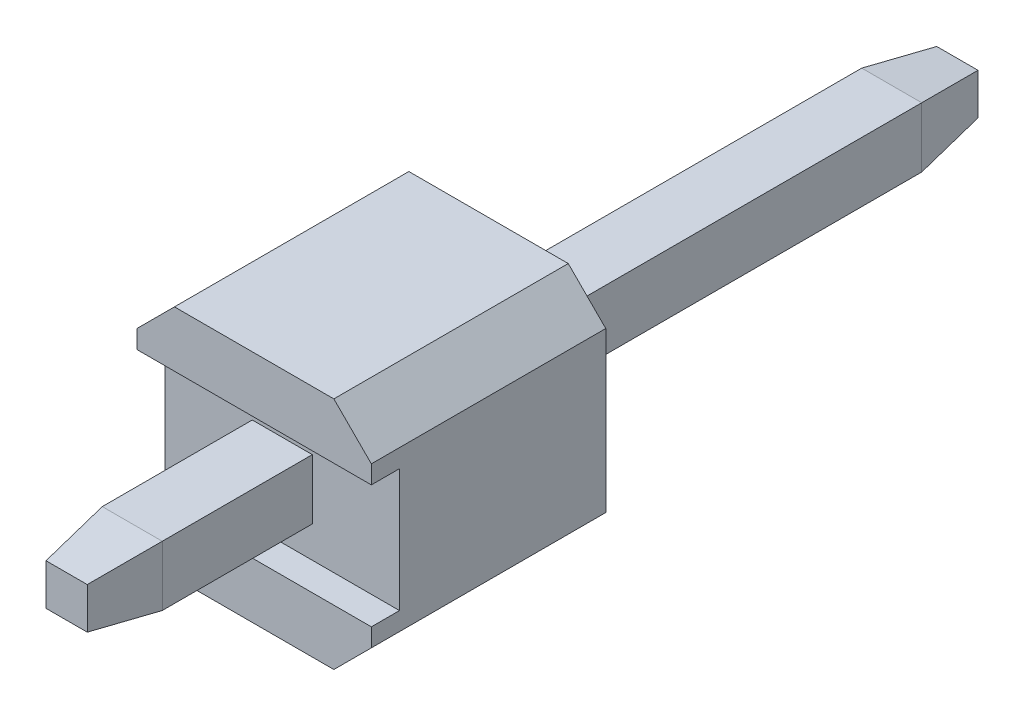
ISO-10303-21;
HEADER;
FILE_DESCRIPTION(('STEP AP214'),'2;1');
FILE_NAME('part.step','',(''),(''),'','','');
FILE_SCHEMA(('AUTOMOTIVE_DESIGN { 1 0 10303 214 1 1 1 1 }'));
ENDSEC;
DATA;
#1=APPLICATION_CONTEXT('core data for automotive mechanical design processes');
#2=APPLICATION_PROTOCOL_DEFINITION('international standard','automotive_design',2000,#1);
#3=PRODUCT_CONTEXT('',#1,'mechanical');
#4=PRODUCT('Part','Part','',(#3));
#5=PRODUCT_RELATED_PRODUCT_CATEGORY('part','',(#4));
#6=PRODUCT_DEFINITION_FORMATION('','',#4);
#7=PRODUCT_DEFINITION_CONTEXT('part definition',#1,'design');
#8=PRODUCT_DEFINITION('design','',#6,#7);
#9=PRODUCT_DEFINITION_SHAPE('','',#8);
#10=(LENGTH_UNIT() NAMED_UNIT(*) SI_UNIT(.MILLI.,.METRE.));
#11=(NAMED_UNIT(*) PLANE_ANGLE_UNIT() SI_UNIT($,.RADIAN.));
#12=(NAMED_UNIT(*) SI_UNIT($,.STERADIAN.) SOLID_ANGLE_UNIT());
#13=UNCERTAINTY_MEASURE_WITH_UNIT(LENGTH_MEASURE(1.E-05),#10,'distance_accuracy_value','');
#14=(GEOMETRIC_REPRESENTATION_CONTEXT(3) GLOBAL_UNCERTAINTY_ASSIGNED_CONTEXT((#13)) GLOBAL_UNIT_ASSIGNED_CONTEXT((#10,
#11,#12)) REPRESENTATION_CONTEXT('',''));
#15=CARTESIAN_POINT('',(0.,0.,0.));
#16=DIRECTION('',(0.,0.,1.));
#17=DIRECTION('',(1.,0.,0.));
#18=AXIS2_PLACEMENT_3D('',#15,#16,#17);
#19=CARTESIAN_POINT('',(-0.16,-0.27,-4.65));
#20=DIRECTION('',(0.,-0.989949493661167,-0.14142135623731));
#21=DIRECTION('',(0.,0.14142135623731,-0.989949493661167));
#22=AXIS2_PLACEMENT_3D('',#19,#20,#21);
#23=PLANE('',#22);
#24=DIRECTION('',(1.,0.,0.));
#25=VECTOR('',#24,1.);
#26=CARTESIAN_POINT('',(-0.16,-0.22,-5.));
#27=LINE('',#26,#25);
#28=CARTESIAN_POINT('',(-0.22,-0.22,-5.));
#29=VERTEX_POINT('',#28);
#30=CARTESIAN_POINT('',(0.22,-0.22,-5.));
#31=VERTEX_POINT('',#30);
#32=EDGE_CURVE('P0_E11',#29,#31,#27,.T.);
#33=ORIENTED_EDGE('',*,*,#32,.T.);
#34=DIRECTION('',(0.140028008402801,-0.140028008402801,0.980196058819607));
#35=VECTOR('',#34,1.);
#36=CARTESIAN_POINT('',(0.22,-0.22,-5.));
#37=LINE('',#36,#35);
#38=CARTESIAN_POINT('',(0.32,-0.32,-4.3));
#39=VERTEX_POINT('',#38);
#40=EDGE_CURVE('P0_E27',#31,#39,#37,.T.);
#41=ORIENTED_EDGE('',*,*,#40,.T.);
#42=DIRECTION('',(-1.,0.,0.));
#43=VECTOR('',#42,1.);
#44=CARTESIAN_POINT('',(-0.16,-0.32,-4.3));
#45=LINE('',#44,#43);
#46=CARTESIAN_POINT('',(-0.32,-0.32,-4.3));
#47=VERTEX_POINT('',#46);
#48=EDGE_CURVE('P0_E102',#39,#47,#45,.T.);
#49=ORIENTED_EDGE('',*,*,#48,.T.);
#50=DIRECTION('',(-0.140028008402801,-0.140028008402801,0.980196058819607));
#51=VECTOR('',#50,1.);
#52=CARTESIAN_POINT('',(-0.22,-0.22,-5.));
#53=LINE('',#52,#51);
#54=EDGE_CURVE('P0_E123',#29,#47,#53,.T.);
#55=ORIENTED_EDGE('',*,*,#54,.F.);
#56=EDGE_LOOP('',(#33,#41,#49,#55));
#57=FACE_BOUND('',#56,.T.);
#58=ADVANCED_FACE('P0_F17',(#57),#23,.T.);
#59=CARTESIAN_POINT('',(0.27,-0.16,-4.65));
#60=DIRECTION('',(0.989949493661167,0.,-0.14142135623731));
#61=DIRECTION('',(0.,-1.,0.));
#62=AXIS2_PLACEMENT_3D('',#59,#60,#61);
#63=PLANE('',#62);
#64=DIRECTION('',(0.,1.,0.));
#65=VECTOR('',#64,1.);
#66=CARTESIAN_POINT('',(0.22,-0.16,-5.));
#67=LINE('',#66,#65);
#68=CARTESIAN_POINT('',(0.22,0.22,-5.));
#69=VERTEX_POINT('',#68);
#70=EDGE_CURVE('P0_E94',#31,#69,#67,.T.);
#71=ORIENTED_EDGE('',*,*,#70,.T.);
#72=DIRECTION('',(0.140028008402801,0.140028008402801,0.980196058819607));
#73=VECTOR('',#72,1.);
#74=CARTESIAN_POINT('',(0.22,0.22,-5.));
#75=LINE('',#74,#73);
#76=CARTESIAN_POINT('',(0.32,0.32,-4.3));
#77=VERTEX_POINT('',#76);
#78=EDGE_CURVE('P0_E87',#69,#77,#75,.T.);
#79=ORIENTED_EDGE('',*,*,#78,.T.);
#80=DIRECTION('',(0.,-1.,0.));
#81=VECTOR('',#80,1.);
#82=CARTESIAN_POINT('',(0.32,-0.16,-4.3));
#83=LINE('',#82,#81);
#84=EDGE_CURVE('P0_E95',#77,#39,#83,.T.);
#85=ORIENTED_EDGE('',*,*,#84,.T.);
#86=ORIENTED_EDGE('',*,*,#40,.F.);
#87=EDGE_LOOP('',(#71,#79,#85,#86));
#88=FACE_BOUND('',#87,.T.);
#89=ADVANCED_FACE('P0_F98',(#88),#63,.T.);
#90=CARTESIAN_POINT('',(0.16,0.27,-4.65));
#91=DIRECTION('',(0.,0.989949493661167,-0.14142135623731));
#92=DIRECTION('',(-1.,0.,0.));
#93=AXIS2_PLACEMENT_3D('',#90,#91,#92);
#94=PLANE('',#93);
#95=DIRECTION('',(-1.,0.,0.));
#96=VECTOR('',#95,1.);
#97=CARTESIAN_POINT('',(0.16,0.22,-5.));
#98=LINE('',#97,#96);
#99=CARTESIAN_POINT('',(-0.22,0.22,-5.));
#100=VERTEX_POINT('',#99);
#101=EDGE_CURVE('P0_E90',#69,#100,#98,.T.);
#102=ORIENTED_EDGE('',*,*,#101,.T.);
#103=DIRECTION('',(-0.140028008402801,0.140028008402801,0.980196058819607));
#104=VECTOR('',#103,1.);
#105=CARTESIAN_POINT('',(-0.22,0.22,-5.));
#106=LINE('',#105,#104);
#107=CARTESIAN_POINT('',(-0.32,0.32,-4.3));
#108=VERTEX_POINT('',#107);
#109=EDGE_CURVE('P0_E108',#100,#108,#106,.T.);
#110=ORIENTED_EDGE('',*,*,#109,.T.);
#111=DIRECTION('',(1.,0.,0.));
#112=VECTOR('',#111,1.);
#113=CARTESIAN_POINT('',(0.16,0.32,-4.3));
#114=LINE('',#113,#112);
#115=EDGE_CURVE('P0_E81',#108,#77,#114,.T.);
#116=ORIENTED_EDGE('',*,*,#115,.T.);
#117=ORIENTED_EDGE('',*,*,#78,.F.);
#118=EDGE_LOOP('',(#102,#110,#116,#117));
#119=FACE_BOUND('',#118,.T.);
#120=ADVANCED_FACE('P0_F88',(#119),#94,.T.);
#121=CARTESIAN_POINT('',(-0.27,0.16,-4.65));
#122=DIRECTION('',(-0.989949493661167,0.,-0.14142135623731));
#123=DIRECTION('',(-0.14142135623731,0.,0.989949493661167));
#124=AXIS2_PLACEMENT_3D('',#121,#122,#123);
#125=PLANE('',#124);
#126=DIRECTION('',(0.,1.,0.));
#127=VECTOR('',#126,1.);
#128=CARTESIAN_POINT('',(-0.32,0.16,-4.3));
#129=LINE('',#128,#127);
#130=EDGE_CURVE('P0_E151',#47,#108,#129,.T.);
#131=ORIENTED_EDGE('',*,*,#130,.T.);
#132=ORIENTED_EDGE('',*,*,#109,.F.);
#133=DIRECTION('',(0.,-1.,0.));
#134=VECTOR('',#133,1.);
#135=CARTESIAN_POINT('',(-0.22,0.16,-5.));
#136=LINE('',#135,#134);
#137=EDGE_CURVE('P0_E106',#100,#29,#136,.T.);
#138=ORIENTED_EDGE('',*,*,#137,.T.);
#139=ORIENTED_EDGE('',*,*,#54,.T.);
#140=EDGE_LOOP('',(#131,#132,#138,#139));
#141=FACE_BOUND('',#140,.T.);
#142=ADVANCED_FACE('P0_F209',(#141),#125,.T.);
#143=CARTESIAN_POINT('',(-0.32,0.32,0.));
#144=DIRECTION('',(-1.,0.,0.));
#145=DIRECTION('',(0.,0.,1.));
#146=AXIS2_PLACEMENT_3D('',#143,#144,#145);
#147=PLANE('',#146);
#148=ORIENTED_EDGE('',*,*,#130,.F.);
#149=DIRECTION('',(0.,0.,1.));
#150=VECTOR('',#149,1.);
#151=CARTESIAN_POINT('',(-0.32,-0.32,0.));
#152=LINE('',#151,#150);
#153=CARTESIAN_POINT('',(-0.32,-0.32,2.));
#154=VERTEX_POINT('',#153);
#155=EDGE_CURVE('P0_E125',#47,#154,#152,.T.);
#156=ORIENTED_EDGE('',*,*,#155,.T.);
#157=DIRECTION('',(0.,-1.,0.));
#158=VECTOR('',#157,1.);
#159=CARTESIAN_POINT('',(-0.32,0.16,2.));
#160=LINE('',#159,#158);
#161=CARTESIAN_POINT('',(-0.32,0.32,2.));
#162=VERTEX_POINT('',#161);
#163=EDGE_CURVE('P0_E118',#162,#154,#160,.T.);
#164=ORIENTED_EDGE('',*,*,#163,.F.);
#165=DIRECTION('',(0.,0.,1.));
#166=VECTOR('',#165,1.);
#167=CARTESIAN_POINT('',(-0.32,0.32,0.));
#168=LINE('',#167,#166);
#169=EDGE_CURVE('P0_E127',#108,#162,#168,.T.);
#170=ORIENTED_EDGE('',*,*,#169,.F.);
#171=EDGE_LOOP('',(#148,#156,#164,#170));
#172=FACE_BOUND('',#171,.T.);
#173=ADVANCED_FACE('P0_F240',(#172),#147,.T.);
#174=CARTESIAN_POINT('',(-0.32,-0.32,0.));
#175=DIRECTION('',(0.,-1.,0.));
#176=DIRECTION('',(0.,0.,-1.));
#177=AXIS2_PLACEMENT_3D('',#174,#175,#176);
#178=PLANE('',#177);
#179=ORIENTED_EDGE('',*,*,#48,.F.);
#180=DIRECTION('',(0.,0.,1.));
#181=VECTOR('',#180,1.);
#182=CARTESIAN_POINT('',(0.32,-0.32,0.));
#183=LINE('',#182,#181);
#184=CARTESIAN_POINT('',(0.32,-0.32,2.));
#185=VERTEX_POINT('',#184);
#186=EDGE_CURVE('P0_E131',#39,#185,#183,.T.);
#187=ORIENTED_EDGE('',*,*,#186,.T.);
#188=DIRECTION('',(1.,0.,0.));
#189=VECTOR('',#188,1.);
#190=CARTESIAN_POINT('',(-0.16,-0.32,2.));
#191=LINE('',#190,#189);
#192=EDGE_CURVE('P0_E122',#154,#185,#191,.T.);
#193=ORIENTED_EDGE('',*,*,#192,.F.);
#194=ORIENTED_EDGE('',*,*,#155,.F.);
#195=EDGE_LOOP('',(#179,#187,#193,#194));
#196=FACE_BOUND('',#195,.T.);
#197=ADVANCED_FACE('P0_F235',(#196),#178,.T.);
#198=CARTESIAN_POINT('',(0.,0.,-5.));
#199=DIRECTION('',(0.,0.,-1.));
#200=DIRECTION('',(0.,-1.,0.));
#201=AXIS2_PLACEMENT_3D('',#198,#199,#200);
#202=PLANE('',#201);
#203=ORIENTED_EDGE('',*,*,#32,.F.);
#204=ORIENTED_EDGE('',*,*,#137,.F.);
#205=ORIENTED_EDGE('',*,*,#101,.F.);
#206=ORIENTED_EDGE('',*,*,#70,.F.);
#207=EDGE_LOOP('',(#203,#204,#205,#206));
#208=FACE_BOUND('',#207,.T.);
#209=ADVANCED_FACE('P0_F104',(#208),#202,.T.);
#210=CARTESIAN_POINT('',(0.32,-0.32,0.));
#211=DIRECTION('',(1.,0.,0.));
#212=DIRECTION('',(0.,1.,0.));
#213=AXIS2_PLACEMENT_3D('',#210,#211,#212);
#214=PLANE('',#213);
#215=ORIENTED_EDGE('',*,*,#84,.F.);
#216=DIRECTION('',(0.,0.,-1.));
#217=VECTOR('',#216,1.);
#218=CARTESIAN_POINT('',(0.32,0.32,0.));
#219=LINE('',#218,#217);
#220=CARTESIAN_POINT('',(0.32,0.32,2.));
#221=VERTEX_POINT('',#220);
#222=EDGE_CURVE('P0_E132',#221,#77,#219,.T.);
#223=ORIENTED_EDGE('',*,*,#222,.F.);
#224=DIRECTION('',(0.,1.,0.));
#225=VECTOR('',#224,1.);
#226=CARTESIAN_POINT('',(0.32,-0.16,2.));
#227=LINE('',#226,#225);
#228=EDGE_CURVE('P0_E20',#185,#221,#227,.T.);
#229=ORIENTED_EDGE('',*,*,#228,.F.);
#230=ORIENTED_EDGE('',*,*,#186,.F.);
#231=EDGE_LOOP('',(#215,#223,#229,#230));
#232=FACE_BOUND('',#231,.T.);
#233=ADVANCED_FACE('P0_F221',(#232),#214,.T.);
#234=CARTESIAN_POINT('',(0.32,0.32,0.));
#235=DIRECTION('',(0.,1.,0.));
#236=DIRECTION('',(1.,0.,0.));
#237=AXIS2_PLACEMENT_3D('',#234,#235,#236);
#238=PLANE('',#237);
#239=ORIENTED_EDGE('',*,*,#115,.F.);
#240=ORIENTED_EDGE('',*,*,#169,.T.);
#241=DIRECTION('',(-1.,0.,0.));
#242=VECTOR('',#241,1.);
#243=CARTESIAN_POINT('',(0.16,0.32,2.));
#244=LINE('',#243,#242);
#245=EDGE_CURVE('P0_E121',#221,#162,#244,.T.);
#246=ORIENTED_EDGE('',*,*,#245,.F.);
#247=ORIENTED_EDGE('',*,*,#222,.T.);
#248=EDGE_LOOP('',(#239,#240,#246,#247));
#249=FACE_BOUND('',#248,.T.);
#250=ADVANCED_FACE('P0_F215',(#249),#238,.T.);
#251=CARTESIAN_POINT('',(0.,0.,2.));
#252=DIRECTION('',(0.,0.,1.));
#253=DIRECTION('',(1.,0.,0.));
#254=AXIS2_PLACEMENT_3D('',#251,#252,#253);
#255=PLANE('',#254);
#256=ORIENTED_EDGE('',*,*,#245,.T.);
#257=ORIENTED_EDGE('',*,*,#163,.T.);
#258=ORIENTED_EDGE('',*,*,#192,.T.);
#259=ORIENTED_EDGE('',*,*,#228,.T.);
#260=EDGE_LOOP('',(#256,#257,#258,#259));
#261=FACE_BOUND('',#260,.T.);
#262=ADVANCED_FACE('P0_F220',(#261),#255,.T.);
#263=CLOSED_SHELL('',(#58,#89,#120,#142,#173,#197,#209,#233,#250,#262));
#264=MANIFOLD_SOLID_BREP('P0_B1',#263);
#265=CARTESIAN_POINT('',(-1.25,0.655430015301126,2.5));
#266=DIRECTION('',(0.,1.,0.));
#267=DIRECTION('',(1.,0.,0.));
#268=AXIS2_PLACEMENT_3D('',#265,#266,#267);
#269=PLANE('',#268);
#270=DIRECTION('',(1.,0.,0.));
#271=VECTOR('',#270,1.);
#272=CARTESIAN_POINT('',(-0.625,0.655430015301126,2.5));
#273=LINE('',#272,#271);
#274=CARTESIAN_POINT('',(-1.25,0.655430015301126,2.5));
#275=VERTEX_POINT('',#274);
#276=CARTESIAN_POINT('',(1.25,0.655430015301126,2.5));
#277=VERTEX_POINT('',#276);
#278=EDGE_CURVE('P1_E300',#275,#277,#273,.T.);
#279=ORIENTED_EDGE('',*,*,#278,.F.);
#280=DIRECTION('',(0.,0.,1.));
#281=VECTOR('',#280,1.);
#282=CARTESIAN_POINT('',(-1.25,0.655430015301126,1.25));
#283=LINE('',#282,#281);
#284=CARTESIAN_POINT('',(-1.25,0.655430015301126,2.2));
#285=VERTEX_POINT('',#284);
#286=EDGE_CURVE('P1_E42',#285,#275,#283,.T.);
#287=ORIENTED_EDGE('',*,*,#286,.F.);
#288=DIRECTION('',(1.,0.,0.));
#289=VECTOR('',#288,1.);
#290=CARTESIAN_POINT('',(-1.25,0.655430015301126,2.2));
#291=LINE('',#290,#289);
#292=CARTESIAN_POINT('',(1.25,0.655430015301126,2.2));
#293=VERTEX_POINT('',#292);
#294=EDGE_CURVE('P1_E11',#285,#293,#291,.T.);
#295=ORIENTED_EDGE('',*,*,#294,.T.);
#296=DIRECTION('',(0.,0.,-1.));
#297=VECTOR('',#296,1.);
#298=CARTESIAN_POINT('',(1.25,0.655430015301126,1.25));
#299=LINE('',#298,#297);
#300=EDGE_CURVE('P1_E189',#277,#293,#299,.T.);
#301=ORIENTED_EDGE('',*,*,#300,.F.);
#302=EDGE_LOOP('',(#279,#287,#295,#301));
#303=FACE_BOUND('',#302,.T.);
#304=ADVANCED_FACE('P1_F17',(#303),#269,.F.);
#305=CARTESIAN_POINT('',(1.25,-0.655430015301126,2.5));
#306=DIRECTION('',(0.,-1.,0.));
#307=DIRECTION('',(0.,0.,-1.));
#308=AXIS2_PLACEMENT_3D('',#305,#306,#307);
#309=PLANE('',#308);
#310=DIRECTION('',(-1.,0.,0.));
#311=VECTOR('',#310,1.);
#312=CARTESIAN_POINT('',(0.625,-0.655430015301126,2.5));
#313=LINE('',#312,#311);
#314=CARTESIAN_POINT('',(1.25,-0.655430015301126,2.5));
#315=VERTEX_POINT('',#314);
#316=CARTESIAN_POINT('',(-1.25,-0.655430015301126,2.5));
#317=VERTEX_POINT('',#316);
#318=EDGE_CURVE('P1_E262',#315,#317,#313,.T.);
#319=ORIENTED_EDGE('',*,*,#318,.F.);
#320=DIRECTION('',(0.,0.,1.));
#321=VECTOR('',#320,1.);
#322=CARTESIAN_POINT('',(1.25,-0.655430015301126,1.25));
#323=LINE('',#322,#321);
#324=CARTESIAN_POINT('',(1.25,-0.655430015301126,2.2));
#325=VERTEX_POINT('',#324);
#326=EDGE_CURVE('P1_E182',#325,#315,#323,.T.);
#327=ORIENTED_EDGE('',*,*,#326,.F.);
#328=DIRECTION('',(-1.,0.,0.));
#329=VECTOR('',#328,1.);
#330=CARTESIAN_POINT('',(1.25,-0.655430015301126,2.2));
#331=LINE('',#330,#329);
#332=CARTESIAN_POINT('',(-1.25,-0.655430015301126,2.2));
#333=VERTEX_POINT('',#332);
#334=EDGE_CURVE('P1_E28',#325,#333,#331,.T.);
#335=ORIENTED_EDGE('',*,*,#334,.T.);
#336=DIRECTION('',(0.,0.,-1.));
#337=VECTOR('',#336,1.);
#338=CARTESIAN_POINT('',(-1.25,-0.655430015301126,1.25));
#339=LINE('',#338,#337);
#340=EDGE_CURVE('P1_E250',#317,#333,#339,.T.);
#341=ORIENTED_EDGE('',*,*,#340,.F.);
#342=EDGE_LOOP('',(#319,#327,#335,#341));
#343=FACE_BOUND('',#342,.T.);
#344=ADVANCED_FACE('P1_F407',(#343),#309,.F.);
#345=CARTESIAN_POINT('',(0.,0.,2.2));
#346=DIRECTION('',(0.,0.,-1.));
#347=DIRECTION('',(0.,-1.,0.));
#348=AXIS2_PLACEMENT_3D('',#345,#346,#347);
#349=PLANE('',#348);
#350=DIRECTION('',(0.,-1.,0.));
#351=VECTOR('',#350,1.);
#352=CARTESIAN_POINT('',(1.25,-0.625,2.2));
#353=LINE('',#352,#351);
#354=EDGE_CURVE('P1_E185',#293,#325,#353,.T.);
#355=ORIENTED_EDGE('',*,*,#354,.F.);
#356=ORIENTED_EDGE('',*,*,#294,.F.);
#357=DIRECTION('',(0.,1.,0.));
#358=VECTOR('',#357,1.);
#359=CARTESIAN_POINT('',(-1.25,0.625,2.2));
#360=LINE('',#359,#358);
#361=EDGE_CURVE('P1_E253',#333,#285,#360,.T.);
#362=ORIENTED_EDGE('',*,*,#361,.F.);
#363=ORIENTED_EDGE('',*,*,#334,.F.);
#364=EDGE_LOOP('',(#355,#356,#362,#363));
#365=FACE_BOUND('',#364,.T.);
#366=DIRECTION('',(0.,-1.,0.));
#367=VECTOR('',#366,1.);
#368=CARTESIAN_POINT('',(-0.32,-0.16,2.2));
#369=LINE('',#368,#367);
#370=CARTESIAN_POINT('',(-0.32,0.32,2.2));
#371=VERTEX_POINT('',#370);
#372=CARTESIAN_POINT('',(-0.32,-0.32,2.2));
#373=VERTEX_POINT('',#372);
#374=EDGE_CURVE('P1_E310',#371,#373,#369,.T.);
#375=ORIENTED_EDGE('',*,*,#374,.F.);
#376=DIRECTION('',(-1.,0.,0.));
#377=VECTOR('',#376,1.);
#378=CARTESIAN_POINT('',(-0.16,0.32,2.2));
#379=LINE('',#378,#377);
#380=CARTESIAN_POINT('',(0.32,0.32,2.2));
#381=VERTEX_POINT('',#380);
#382=EDGE_CURVE('P1_E179',#381,#371,#379,.T.);
#383=ORIENTED_EDGE('',*,*,#382,.F.);
#384=DIRECTION('',(0.,1.,0.));
#385=VECTOR('',#384,1.);
#386=CARTESIAN_POINT('',(0.32,0.16,2.2));
#387=LINE('',#386,#385);
#388=CARTESIAN_POINT('',(0.32,-0.32,2.2));
#389=VERTEX_POINT('',#388);
#390=EDGE_CURVE('P1_E186',#389,#381,#387,.T.);
#391=ORIENTED_EDGE('',*,*,#390,.F.);
#392=DIRECTION('',(1.,0.,0.));
#393=VECTOR('',#392,1.);
#394=CARTESIAN_POINT('',(0.16,-0.32,2.2));
#395=LINE('',#394,#393);
#396=EDGE_CURVE('P1_E208',#373,#389,#395,.T.);
#397=ORIENTED_EDGE('',*,*,#396,.F.);
#398=EDGE_LOOP('',(#375,#383,#391,#397));
#399=FACE_BOUND('',#398,.T.);
#400=ADVANCED_FACE('P1_F431',(#365,#399),#349,.F.);
#401=CARTESIAN_POINT('',(0.,0.,2.5));
#402=DIRECTION('',(0.,0.,1.));
#403=DIRECTION('',(1.,0.,0.));
#404=AXIS2_PLACEMENT_3D('',#401,#402,#403);
#405=PLANE('',#404);
#406=ORIENTED_EDGE('',*,*,#318,.T.);
#407=DIRECTION('',(0.,-1.,0.));
#408=VECTOR('',#407,1.);
#409=CARTESIAN_POINT('',(-1.25,-1.25,2.5));
#410=LINE('',#409,#408);
#411=CARTESIAN_POINT('',(-1.25,-0.85,2.5));
#412=VERTEX_POINT('',#411);
#413=EDGE_CURVE('P1_E272',#317,#412,#410,.T.);
#414=ORIENTED_EDGE('',*,*,#413,.T.);
#415=DIRECTION('',(-0.707106781186548,0.707106781186548,0.));
#416=VECTOR('',#415,1.);
#417=CARTESIAN_POINT('',(-1.05,-1.05,2.5));
#418=LINE('',#417,#416);
#419=CARTESIAN_POINT('',(-0.85,-1.25,2.5));
#420=VERTEX_POINT('',#419);
#421=EDGE_CURVE('P1_E199',#420,#412,#418,.T.);
#422=ORIENTED_EDGE('',*,*,#421,.F.);
#423=DIRECTION('',(1.,0.,0.));
#424=VECTOR('',#423,1.);
#425=CARTESIAN_POINT('',(1.25,-1.25,2.5));
#426=LINE('',#425,#424);
#427=CARTESIAN_POINT('',(0.85,-1.25,2.5));
#428=VERTEX_POINT('',#427);
#429=EDGE_CURVE('P1_E282',#420,#428,#426,.T.);
#430=ORIENTED_EDGE('',*,*,#429,.T.);
#431=DIRECTION('',(-0.707106781186548,-0.707106781186548,0.));
#432=VECTOR('',#431,1.);
#433=CARTESIAN_POINT('',(1.05,-1.05,2.5));
#434=LINE('',#433,#432);
#435=CARTESIAN_POINT('',(1.25,-0.85,2.5));
#436=VERTEX_POINT('',#435);
#437=EDGE_CURVE('P1_E204',#436,#428,#434,.T.);
#438=ORIENTED_EDGE('',*,*,#437,.F.);
#439=DIRECTION('',(0.,1.,0.));
#440=VECTOR('',#439,1.);
#441=CARTESIAN_POINT('',(1.25,1.25,2.5));
#442=LINE('',#441,#440);
#443=EDGE_CURVE('P1_E305',#436,#315,#442,.T.);
#444=ORIENTED_EDGE('',*,*,#443,.T.);
#445=EDGE_LOOP('',(#406,#414,#422,#430,#438,#444));
#446=FACE_BOUND('',#445,.T.);
#447=ADVANCED_FACE('P1_F331',(#446),#405,.T.);
#448=CARTESIAN_POINT('',(0.,0.,2.5));
#449=DIRECTION('',(0.,0.,1.));
#450=DIRECTION('',(1.,0.,0.));
#451=AXIS2_PLACEMENT_3D('',#448,#449,#450);
#452=PLANE('',#451);
#453=ORIENTED_EDGE('',*,*,#278,.T.);
#454=DIRECTION('',(0.,1.,0.));
#455=VECTOR('',#454,1.);
#456=CARTESIAN_POINT('',(1.25,1.25,2.5));
#457=LINE('',#456,#455);
#458=CARTESIAN_POINT('',(1.25,0.85,2.5));
#459=VERTEX_POINT('',#458);
#460=EDGE_CURVE('P1_E291',#277,#459,#457,.T.);
#461=ORIENTED_EDGE('',*,*,#460,.T.);
#462=DIRECTION('',(0.707106781186548,-0.707106781186548,0.));
#463=VECTOR('',#462,1.);
#464=CARTESIAN_POINT('',(1.05,1.05,2.5));
#465=LINE('',#464,#463);
#466=CARTESIAN_POINT('',(0.85,1.25,2.5));
#467=VERTEX_POINT('',#466);
#468=EDGE_CURVE('P1_E169',#467,#459,#465,.T.);
#469=ORIENTED_EDGE('',*,*,#468,.F.);
#470=DIRECTION('',(-1.,0.,0.));
#471=VECTOR('',#470,1.);
#472=CARTESIAN_POINT('',(-1.25,1.25,2.5));
#473=LINE('',#472,#471);
#474=CARTESIAN_POINT('',(-0.85,1.25,2.5));
#475=VERTEX_POINT('',#474);
#476=EDGE_CURVE('P1_E287',#467,#475,#473,.T.);
#477=ORIENTED_EDGE('',*,*,#476,.T.);
#478=DIRECTION('',(0.707106781186548,0.707106781186548,0.));
#479=VECTOR('',#478,1.);
#480=CARTESIAN_POINT('',(-1.05,1.05,2.5));
#481=LINE('',#480,#479);
#482=CARTESIAN_POINT('',(-1.25,0.85,2.5));
#483=VERTEX_POINT('',#482);
#484=EDGE_CURVE('P1_E222',#483,#475,#481,.T.);
#485=ORIENTED_EDGE('',*,*,#484,.F.);
#486=DIRECTION('',(0.,-1.,0.));
#487=VECTOR('',#486,1.);
#488=CARTESIAN_POINT('',(-1.25,-1.25,2.5));
#489=LINE('',#488,#487);
#490=EDGE_CURVE('P1_E167',#483,#275,#489,.T.);
#491=ORIENTED_EDGE('',*,*,#490,.T.);
#492=EDGE_LOOP('',(#453,#461,#469,#477,#485,#491));
#493=FACE_BOUND('',#492,.T.);
#494=ADVANCED_FACE('P1_F446',(#493),#452,.T.);
#495=CARTESIAN_POINT('',(1.25,-1.25,0.));
#496=DIRECTION('',(1.,0.,0.));
#497=DIRECTION('',(0.,1.,0.));
#498=AXIS2_PLACEMENT_3D('',#495,#496,#497);
#499=PLANE('',#498);
#500=ORIENTED_EDGE('',*,*,#300,.T.);
#501=ORIENTED_EDGE('',*,*,#354,.T.);
#502=ORIENTED_EDGE('',*,*,#326,.T.);
#503=ORIENTED_EDGE('',*,*,#443,.F.);
#504=DIRECTION('',(0.,0.,1.));
#505=VECTOR('',#504,1.);
#506=CARTESIAN_POINT('',(1.25,-0.85,0.));
#507=LINE('',#506,#505);
#508=CARTESIAN_POINT('',(1.25,-0.85,0.));
#509=VERTEX_POINT('',#508);
#510=EDGE_CURVE('P1_E239',#509,#436,#507,.T.);
#511=ORIENTED_EDGE('',*,*,#510,.F.);
#512=DIRECTION('',(0.,-1.,0.));
#513=VECTOR('',#512,1.);
#514=CARTESIAN_POINT('',(1.25,1.25,0.));
#515=LINE('',#514,#513);
#516=CARTESIAN_POINT('',(1.25,0.85,0.));
#517=VERTEX_POINT('',#516);
#518=EDGE_CURVE('P1_E211',#517,#509,#515,.T.);
#519=ORIENTED_EDGE('',*,*,#518,.F.);
#520=DIRECTION('',(0.,0.,-1.));
#521=VECTOR('',#520,1.);
#522=CARTESIAN_POINT('',(1.25,0.85,0.));
#523=LINE('',#522,#521);
#524=EDGE_CURVE('P1_E176',#459,#517,#523,.T.);
#525=ORIENTED_EDGE('',*,*,#524,.F.);
#526=ORIENTED_EDGE('',*,*,#460,.F.);
#527=EDGE_LOOP('',(#500,#501,#502,#503,#511,#519,#525,#526));
#528=FACE_BOUND('',#527,.T.);
#529=ADVANCED_FACE('P1_F441',(#528),#499,.T.);
#530=CARTESIAN_POINT('',(0.32,0.32,0.));
#531=DIRECTION('',(-1.,0.,0.));
#532=DIRECTION('',(0.,0.,1.));
#533=AXIS2_PLACEMENT_3D('',#530,#531,#532);
#534=PLANE('',#533);
#535=ORIENTED_EDGE('',*,*,#390,.T.);
#536=DIRECTION('',(0.,0.,1.));
#537=VECTOR('',#536,1.);
#538=CARTESIAN_POINT('',(0.32,0.32,0.));
#539=LINE('',#538,#537);
#540=CARTESIAN_POINT('',(0.32,0.32,0.));
#541=VERTEX_POINT('',#540);
#542=EDGE_CURVE('P1_E296',#541,#381,#539,.T.);
#543=ORIENTED_EDGE('',*,*,#542,.F.);
#544=DIRECTION('',(0.,-1.,0.));
#545=VECTOR('',#544,1.);
#546=CARTESIAN_POINT('',(0.32,0.32,0.));
#547=LINE('',#546,#545);
#548=CARTESIAN_POINT('',(0.32,-0.32,0.));
#549=VERTEX_POINT('',#548);
#550=EDGE_CURVE('P1_E191',#541,#549,#547,.T.);
#551=ORIENTED_EDGE('',*,*,#550,.T.);
#552=DIRECTION('',(0.,0.,1.));
#553=VECTOR('',#552,1.);
#554=CARTESIAN_POINT('',(0.32,-0.32,0.));
#555=LINE('',#554,#553);
#556=EDGE_CURVE('P1_E195',#549,#389,#555,.T.);
#557=ORIENTED_EDGE('',*,*,#556,.T.);
#558=EDGE_LOOP('',(#535,#543,#551,#557));
#559=FACE_BOUND('',#558,.T.);
#560=ADVANCED_FACE('P1_F359',(#559),#534,.T.);
#561=CARTESIAN_POINT('',(-0.32,0.32,0.));
#562=DIRECTION('',(0.,-1.,0.));
#563=DIRECTION('',(0.,0.,-1.));
#564=AXIS2_PLACEMENT_3D('',#561,#562,#563);
#565=PLANE('',#564);
#566=ORIENTED_EDGE('',*,*,#382,.T.);
#567=DIRECTION('',(0.,0.,1.));
#568=VECTOR('',#567,1.);
#569=CARTESIAN_POINT('',(-0.32,0.32,0.));
#570=LINE('',#569,#568);
#571=CARTESIAN_POINT('',(-0.32,0.32,0.));
#572=VERTEX_POINT('',#571);
#573=EDGE_CURVE('P1_E246',#572,#371,#570,.T.);
#574=ORIENTED_EDGE('',*,*,#573,.F.);
#575=DIRECTION('',(1.,0.,0.));
#576=VECTOR('',#575,1.);
#577=CARTESIAN_POINT('',(-0.32,0.32,0.));
#578=LINE('',#577,#576);
#579=EDGE_CURVE('P1_E348',#572,#541,#578,.T.);
#580=ORIENTED_EDGE('',*,*,#579,.T.);
#581=ORIENTED_EDGE('',*,*,#542,.T.);
#582=EDGE_LOOP('',(#566,#574,#580,#581));
#583=FACE_BOUND('',#582,.T.);
#584=ADVANCED_FACE('P1_F364',(#583),#565,.T.);
#585=CARTESIAN_POINT('',(-1.05,-1.05,0.));
#586=DIRECTION('',(-0.707106781186548,-0.707106781186548,0.));
#587=DIRECTION('',(-0.707106781186548,0.707106781186548,0.));
#588=AXIS2_PLACEMENT_3D('',#585,#586,#587);
#589=PLANE('',#588);
#590=ORIENTED_EDGE('',*,*,#421,.T.);
#591=DIRECTION('',(0.,0.,-1.));
#592=VECTOR('',#591,1.);
#593=CARTESIAN_POINT('',(-1.25,-0.85,0.));
#594=LINE('',#593,#592);
#595=CARTESIAN_POINT('',(-1.25,-0.85,0.));
#596=VERTEX_POINT('',#595);
#597=EDGE_CURVE('P1_E196',#412,#596,#594,.T.);
#598=ORIENTED_EDGE('',*,*,#597,.T.);
#599=DIRECTION('',(0.707106781186548,-0.707106781186548,0.));
#600=VECTOR('',#599,1.);
#601=CARTESIAN_POINT('',(-1.05,-1.05,0.));
#602=LINE('',#601,#600);
#603=CARTESIAN_POINT('',(-0.85,-1.25,0.));
#604=VERTEX_POINT('',#603);
#605=EDGE_CURVE('P1_E158',#596,#604,#602,.T.);
#606=ORIENTED_EDGE('',*,*,#605,.T.);
#607=DIRECTION('',(0.,0.,1.));
#608=VECTOR('',#607,1.);
#609=CARTESIAN_POINT('',(-0.85,-1.25,0.));
#610=LINE('',#609,#608);
#611=EDGE_CURVE('P1_E162',#604,#420,#610,.T.);
#612=ORIENTED_EDGE('',*,*,#611,.T.);
#613=EDGE_LOOP('',(#590,#598,#606,#612));
#614=FACE_BOUND('',#613,.T.);
#615=ADVANCED_FACE('P1_F19',(#614),#589,.T.);
#616=CARTESIAN_POINT('',(-1.25,-1.25,0.));
#617=DIRECTION('',(0.,-1.,0.));
#618=DIRECTION('',(0.,0.,-1.));
#619=AXIS2_PLACEMENT_3D('',#616,#617,#618);
#620=PLANE('',#619);
#621=ORIENTED_EDGE('',*,*,#611,.F.);
#622=DIRECTION('',(-1.,0.,0.));
#623=VECTOR('',#622,1.);
#624=CARTESIAN_POINT('',(1.25,-1.25,0.));
#625=LINE('',#624,#623);
#626=CARTESIAN_POINT('',(0.85,-1.25,0.));
#627=VERTEX_POINT('',#626);
#628=EDGE_CURVE('P1_E214',#627,#604,#625,.T.);
#629=ORIENTED_EDGE('',*,*,#628,.F.);
#630=DIRECTION('',(0.,0.,-1.));
#631=VECTOR('',#630,1.);
#632=CARTESIAN_POINT('',(0.85,-1.25,0.));
#633=LINE('',#632,#631);
#634=EDGE_CURVE('P1_E238',#428,#627,#633,.T.);
#635=ORIENTED_EDGE('',*,*,#634,.F.);
#636=ORIENTED_EDGE('',*,*,#429,.F.);
#637=EDGE_LOOP('',(#621,#629,#635,#636));
#638=FACE_BOUND('',#637,.T.);
#639=ADVANCED_FACE('P1_F335',(#638),#620,.T.);
#640=CARTESIAN_POINT('',(0.,0.,0.));
#641=DIRECTION('',(0.,0.,1.));
#642=DIRECTION('',(1.,0.,0.));
#643=AXIS2_PLACEMENT_3D('',#640,#641,#642);
#644=PLANE('',#643);
#645=ORIENTED_EDGE('',*,*,#605,.F.);
#646=DIRECTION('',(0.,1.,0.));
#647=VECTOR('',#646,1.);
#648=CARTESIAN_POINT('',(-1.25,-1.25,0.));
#649=LINE('',#648,#647);
#650=CARTESIAN_POINT('',(-1.25,0.85,0.));
#651=VERTEX_POINT('',#650);
#652=EDGE_CURVE('P1_E153',#596,#651,#649,.T.);
#653=ORIENTED_EDGE('',*,*,#652,.T.);
#654=DIRECTION('',(-0.707106781186548,-0.707106781186548,0.));
#655=VECTOR('',#654,1.);
#656=CARTESIAN_POINT('',(-1.05,1.05,0.));
#657=LINE('',#656,#655);
#658=CARTESIAN_POINT('',(-0.85,1.25,0.));
#659=VERTEX_POINT('',#658);
#660=EDGE_CURVE('P1_E140',#659,#651,#657,.T.);
#661=ORIENTED_EDGE('',*,*,#660,.F.);
#662=DIRECTION('',(1.,0.,0.));
#663=VECTOR('',#662,1.);
#664=CARTESIAN_POINT('',(-1.25,1.25,0.));
#665=LINE('',#664,#663);
#666=CARTESIAN_POINT('',(0.85,1.25,0.));
#667=VERTEX_POINT('',#666);
#668=EDGE_CURVE('P1_E163',#659,#667,#665,.T.);
#669=ORIENTED_EDGE('',*,*,#668,.T.);
#670=DIRECTION('',(-0.707106781186548,0.707106781186548,0.));
#671=VECTOR('',#670,1.);
#672=CARTESIAN_POINT('',(1.05,1.05,0.));
#673=LINE('',#672,#671);
#674=EDGE_CURVE('P1_E21',#517,#667,#673,.T.);
#675=ORIENTED_EDGE('',*,*,#674,.F.);
#676=ORIENTED_EDGE('',*,*,#518,.T.);
#677=DIRECTION('',(0.707106781186548,0.707106781186548,0.));
#678=VECTOR('',#677,1.);
#679=CARTESIAN_POINT('',(1.05,-1.05,0.));
#680=LINE('',#679,#678);
#681=EDGE_CURVE('P1_E235',#627,#509,#680,.T.);
#682=ORIENTED_EDGE('',*,*,#681,.F.);
#683=ORIENTED_EDGE('',*,*,#628,.T.);
#684=EDGE_LOOP('',(#645,#653,#661,#669,#675,#676,#682,#683));
#685=FACE_BOUND('',#684,.T.);
#686=ORIENTED_EDGE('',*,*,#579,.F.);
#687=DIRECTION('',(0.,1.,0.));
#688=VECTOR('',#687,1.);
#689=CARTESIAN_POINT('',(-0.32,-0.32,0.));
#690=LINE('',#689,#688);
#691=CARTESIAN_POINT('',(-0.32,-0.32,0.));
#692=VERTEX_POINT('',#691);
#693=EDGE_CURVE('P1_E259',#692,#572,#690,.T.);
#694=ORIENTED_EDGE('',*,*,#693,.F.);
#695=DIRECTION('',(-1.,0.,0.));
#696=VECTOR('',#695,1.);
#697=CARTESIAN_POINT('',(0.32,-0.32,0.));
#698=LINE('',#697,#696);
#699=EDGE_CURVE('P1_E205',#549,#692,#698,.T.);
#700=ORIENTED_EDGE('',*,*,#699,.F.);
#701=ORIENTED_EDGE('',*,*,#550,.F.);
#702=EDGE_LOOP('',(#686,#694,#700,#701));
#703=FACE_BOUND('',#702,.T.);
#704=ADVANCED_FACE('P1_F154',(#685,#703),#644,.F.);
#705=CARTESIAN_POINT('',(-1.05,1.05,0.));
#706=DIRECTION('',(-0.707106781186548,0.707106781186548,0.));
#707=DIRECTION('',(0.,0.,1.));
#708=AXIS2_PLACEMENT_3D('',#705,#706,#707);
#709=PLANE('',#708);
#710=ORIENTED_EDGE('',*,*,#484,.T.);
#711=DIRECTION('',(0.,0.,-1.));
#712=VECTOR('',#711,1.);
#713=CARTESIAN_POINT('',(-0.85,1.25,0.));
#714=LINE('',#713,#712);
#715=EDGE_CURVE('P1_E146',#475,#659,#714,.T.);
#716=ORIENTED_EDGE('',*,*,#715,.T.);
#717=ORIENTED_EDGE('',*,*,#660,.T.);
#718=DIRECTION('',(0.,0.,1.));
#719=VECTOR('',#718,1.);
#720=CARTESIAN_POINT('',(-1.25,0.85,0.));
#721=LINE('',#720,#719);
#722=EDGE_CURVE('P1_E144',#651,#483,#721,.T.);
#723=ORIENTED_EDGE('',*,*,#722,.T.);
#724=EDGE_LOOP('',(#710,#716,#717,#723));
#725=FACE_BOUND('',#724,.T.);
#726=ADVANCED_FACE('P1_F142',(#725),#709,.T.);
#727=CARTESIAN_POINT('',(1.25,1.25,0.));
#728=DIRECTION('',(0.,1.,0.));
#729=DIRECTION('',(1.,0.,0.));
#730=AXIS2_PLACEMENT_3D('',#727,#728,#729);
#731=PLANE('',#730);
#732=ORIENTED_EDGE('',*,*,#715,.F.);
#733=ORIENTED_EDGE('',*,*,#476,.F.);
#734=DIRECTION('',(0.,0.,1.));
#735=VECTOR('',#734,1.);
#736=CARTESIAN_POINT('',(0.85,1.25,0.));
#737=LINE('',#736,#735);
#738=EDGE_CURVE('P1_E200',#667,#467,#737,.T.);
#739=ORIENTED_EDGE('',*,*,#738,.F.);
#740=ORIENTED_EDGE('',*,*,#668,.F.);
#741=EDGE_LOOP('',(#732,#733,#739,#740));
#742=FACE_BOUND('',#741,.T.);
#743=ADVANCED_FACE('P1_F481',(#742),#731,.T.);
#744=CARTESIAN_POINT('',(1.05,1.05,0.));
#745=DIRECTION('',(0.707106781186548,0.707106781186548,0.));
#746=DIRECTION('',(0.,0.,-1.));
#747=AXIS2_PLACEMENT_3D('',#744,#745,#746);
#748=PLANE('',#747);
#749=ORIENTED_EDGE('',*,*,#468,.T.);
#750=ORIENTED_EDGE('',*,*,#524,.T.);
#751=ORIENTED_EDGE('',*,*,#674,.T.);
#752=ORIENTED_EDGE('',*,*,#738,.T.);
#753=EDGE_LOOP('',(#749,#750,#751,#752));
#754=FACE_BOUND('',#753,.T.);
#755=ADVANCED_FACE('P1_F464',(#754),#748,.T.);
#756=CARTESIAN_POINT('',(1.05,-1.05,0.));
#757=DIRECTION('',(0.707106781186548,-0.707106781186548,0.));
#758=DIRECTION('',(0.,0.,-1.));
#759=AXIS2_PLACEMENT_3D('',#756,#757,#758);
#760=PLANE('',#759);
#761=ORIENTED_EDGE('',*,*,#437,.T.);
#762=ORIENTED_EDGE('',*,*,#634,.T.);
#763=ORIENTED_EDGE('',*,*,#681,.T.);
#764=ORIENTED_EDGE('',*,*,#510,.T.);
#765=EDGE_LOOP('',(#761,#762,#763,#764));
#766=FACE_BOUND('',#765,.T.);
#767=ADVANCED_FACE('P1_F325',(#766),#760,.T.);
#768=CARTESIAN_POINT('',(-0.32,-0.32,0.));
#769=DIRECTION('',(1.,0.,0.));
#770=DIRECTION('',(0.,1.,0.));
#771=AXIS2_PLACEMENT_3D('',#768,#769,#770);
#772=PLANE('',#771);
#773=ORIENTED_EDGE('',*,*,#374,.T.);
#774=DIRECTION('',(0.,0.,1.));
#775=VECTOR('',#774,1.);
#776=CARTESIAN_POINT('',(-0.32,-0.32,0.));
#777=LINE('',#776,#775);
#778=EDGE_CURVE('P1_E209',#692,#373,#777,.T.);
#779=ORIENTED_EDGE('',*,*,#778,.F.);
#780=ORIENTED_EDGE('',*,*,#693,.T.);
#781=ORIENTED_EDGE('',*,*,#573,.T.);
#782=EDGE_LOOP('',(#773,#779,#780,#781));
#783=FACE_BOUND('',#782,.T.);
#784=ADVANCED_FACE('P1_F418',(#783),#772,.T.);
#785=CARTESIAN_POINT('',(0.32,-0.32,0.));
#786=DIRECTION('',(0.,1.,0.));
#787=DIRECTION('',(1.,0.,0.));
#788=AXIS2_PLACEMENT_3D('',#785,#786,#787);
#789=PLANE('',#788);
#790=ORIENTED_EDGE('',*,*,#396,.T.);
#791=ORIENTED_EDGE('',*,*,#556,.F.);
#792=ORIENTED_EDGE('',*,*,#699,.T.);
#793=ORIENTED_EDGE('',*,*,#778,.T.);
#794=EDGE_LOOP('',(#790,#791,#792,#793));
#795=FACE_BOUND('',#794,.T.);
#796=ADVANCED_FACE('P1_F413',(#795),#789,.T.);
#797=CARTESIAN_POINT('',(-1.25,1.25,0.));
#798=DIRECTION('',(-1.,0.,0.));
#799=DIRECTION('',(0.,0.,1.));
#800=AXIS2_PLACEMENT_3D('',#797,#798,#799);
#801=PLANE('',#800);
#802=ORIENTED_EDGE('',*,*,#286,.T.);
#803=ORIENTED_EDGE('',*,*,#490,.F.);
#804=ORIENTED_EDGE('',*,*,#722,.F.);
#805=ORIENTED_EDGE('',*,*,#652,.F.);
#806=ORIENTED_EDGE('',*,*,#597,.F.);
#807=ORIENTED_EDGE('',*,*,#413,.F.);
#808=ORIENTED_EDGE('',*,*,#340,.T.);
#809=ORIENTED_EDGE('',*,*,#361,.T.);
#810=EDGE_LOOP('',(#802,#803,#804,#805,#806,#807,#808,#809));
#811=FACE_BOUND('',#810,.T.);
#812=ADVANCED_FACE('P1_F165',(#811),#801,.T.);
#813=CLOSED_SHELL('',(#304,#344,#400,#447,#494,#529,#560,#584,#615,#639,#704,#726,#743,#755,
#767,#784,#796,#812));
#814=MANIFOLD_SOLID_BREP('P1_B1',#813);
#815=CARTESIAN_POINT('',(0.27,-0.16,4.15));
#816=DIRECTION('',(0.989949493661167,0.,0.141421356237309));
#817=DIRECTION('',(0.,-1.,0.));
#818=AXIS2_PLACEMENT_3D('',#815,#816,#817);
#819=PLANE('',#818);
#820=DIRECTION('',(0.,-1.,0.));
#821=VECTOR('',#820,1.);
#822=CARTESIAN_POINT('',(0.22,-0.16,4.5));
#823=LINE('',#822,#821);
#824=CARTESIAN_POINT('',(0.22,0.22,4.5));
#825=VERTEX_POINT('',#824);
#826=CARTESIAN_POINT('',(0.22,-0.22,4.5));
#827=VERTEX_POINT('',#826);
#828=EDGE_CURVE('P2_E11',#825,#827,#823,.T.);
#829=ORIENTED_EDGE('',*,*,#828,.T.);
#830=DIRECTION('',(0.140028008402801,-0.140028008402801,-0.980196058819607));
#831=VECTOR('',#830,1.);
#832=CARTESIAN_POINT('',(0.22,-0.22,4.5));
#833=LINE('',#832,#831);
#834=CARTESIAN_POINT('',(0.32,-0.32,3.8));
#835=VERTEX_POINT('',#834);
#836=EDGE_CURVE('P2_E28',#827,#835,#833,.T.);
#837=ORIENTED_EDGE('',*,*,#836,.T.);
#838=DIRECTION('',(0.,1.,0.));
#839=VECTOR('',#838,1.);
#840=CARTESIAN_POINT('',(0.32,-0.16,3.8));
#841=LINE('',#840,#839);
#842=CARTESIAN_POINT('',(0.32,0.32,3.8));
#843=VERTEX_POINT('',#842);
#844=EDGE_CURVE('P2_E121',#835,#843,#841,.T.);
#845=ORIENTED_EDGE('',*,*,#844,.T.);
#846=DIRECTION('',(0.140028008402801,0.140028008402801,-0.980196058819607));
#847=VECTOR('',#846,1.);
#848=CARTESIAN_POINT('',(0.22,0.22,4.5));
#849=LINE('',#848,#847);
#850=EDGE_CURVE('P2_E21',#825,#843,#849,.T.);
#851=ORIENTED_EDGE('',*,*,#850,.F.);
#852=EDGE_LOOP('',(#829,#837,#845,#851));
#853=FACE_BOUND('',#852,.T.);
#854=ADVANCED_FACE('P2_F17',(#853),#819,.T.);
#855=CARTESIAN_POINT('',(-0.16,-0.27,4.15));
#856=DIRECTION('',(0.,-0.989949493661167,0.141421356237309));
#857=DIRECTION('',(-1.,0.,0.));
#858=AXIS2_PLACEMENT_3D('',#855,#856,#857);
#859=PLANE('',#858);
#860=DIRECTION('',(-1.,0.,0.));
#861=VECTOR('',#860,1.);
#862=CARTESIAN_POINT('',(-0.16,-0.22,4.5));
#863=LINE('',#862,#861);
#864=CARTESIAN_POINT('',(-0.22,-0.22,4.5));
#865=VERTEX_POINT('',#864);
#866=EDGE_CURVE('P2_E123',#827,#865,#863,.T.);
#867=ORIENTED_EDGE('',*,*,#866,.T.);
#868=DIRECTION('',(-0.140028008402801,-0.140028008402801,-0.980196058819607));
#869=VECTOR('',#868,1.);
#870=CARTESIAN_POINT('',(-0.22,-0.22,4.5));
#871=LINE('',#870,#869);
#872=CARTESIAN_POINT('',(-0.32,-0.32,3.8));
#873=VERTEX_POINT('',#872);
#874=EDGE_CURVE('P2_E163',#865,#873,#871,.T.);
#875=ORIENTED_EDGE('',*,*,#874,.T.);
#876=DIRECTION('',(1.,0.,0.));
#877=VECTOR('',#876,1.);
#878=CARTESIAN_POINT('',(-0.16,-0.32,3.8));
#879=LINE('',#878,#877);
#880=EDGE_CURVE('P2_E161',#873,#835,#879,.T.);
#881=ORIENTED_EDGE('',*,*,#880,.T.);
#882=ORIENTED_EDGE('',*,*,#836,.F.);
#883=EDGE_LOOP('',(#867,#875,#881,#882));
#884=FACE_BOUND('',#883,.T.);
#885=ADVANCED_FACE('P2_F258',(#884),#859,.T.);
#886=CARTESIAN_POINT('',(-0.27,0.16,4.15));
#887=DIRECTION('',(-0.989949493661167,0.,0.141421356237309));
#888=DIRECTION('',(0.,1.,0.));
#889=AXIS2_PLACEMENT_3D('',#886,#887,#888);
#890=PLANE('',#889);
#891=DIRECTION('',(0.,1.,0.));
#892=VECTOR('',#891,1.);
#893=CARTESIAN_POINT('',(-0.22,0.16,4.5));
#894=LINE('',#893,#892);
#895=CARTESIAN_POINT('',(-0.22,0.22,4.5));
#896=VERTEX_POINT('',#895);
#897=EDGE_CURVE('P2_E155',#865,#896,#894,.T.);
#898=ORIENTED_EDGE('',*,*,#897,.T.);
#899=DIRECTION('',(-0.140028008402801,0.140028008402801,-0.980196058819607));
#900=VECTOR('',#899,1.);
#901=CARTESIAN_POINT('',(-0.22,0.22,4.5));
#902=LINE('',#901,#900);
#903=CARTESIAN_POINT('',(-0.32,0.32,3.8));
#904=VERTEX_POINT('',#903);
#905=EDGE_CURVE('P2_E151',#896,#904,#902,.T.);
#906=ORIENTED_EDGE('',*,*,#905,.T.);
#907=DIRECTION('',(0.,-1.,0.));
#908=VECTOR('',#907,1.);
#909=CARTESIAN_POINT('',(-0.32,0.16,3.8));
#910=LINE('',#909,#908);
#911=EDGE_CURVE('P2_E119',#904,#873,#910,.T.);
#912=ORIENTED_EDGE('',*,*,#911,.T.);
#913=ORIENTED_EDGE('',*,*,#874,.F.);
#914=EDGE_LOOP('',(#898,#906,#912,#913));
#915=FACE_BOUND('',#914,.T.);
#916=ADVANCED_FACE('P2_F175',(#915),#890,.T.);
#917=CARTESIAN_POINT('',(0.16,0.27,4.15));
#918=DIRECTION('',(0.,0.989949493661167,0.141421356237309));
#919=DIRECTION('',(1.,0.,0.));
#920=AXIS2_PLACEMENT_3D('',#917,#918,#919);
#921=PLANE('',#920);
#922=DIRECTION('',(-1.,0.,0.));
#923=VECTOR('',#922,1.);
#924=CARTESIAN_POINT('',(0.16,0.32,3.8));
#925=LINE('',#924,#923);
#926=EDGE_CURVE('P2_E105',#843,#904,#925,.T.);
#927=ORIENTED_EDGE('',*,*,#926,.T.);
#928=ORIENTED_EDGE('',*,*,#905,.F.);
#929=DIRECTION('',(1.,0.,0.));
#930=VECTOR('',#929,1.);
#931=CARTESIAN_POINT('',(0.16,0.22,4.5));
#932=LINE('',#931,#930);
#933=EDGE_CURVE('P2_E107',#896,#825,#932,.T.);
#934=ORIENTED_EDGE('',*,*,#933,.T.);
#935=ORIENTED_EDGE('',*,*,#850,.T.);
#936=EDGE_LOOP('',(#927,#928,#934,#935));
#937=FACE_BOUND('',#936,.T.);
#938=ADVANCED_FACE('P2_F19',(#937),#921,.T.);
#939=CARTESIAN_POINT('',(0.32,0.32,2.));
#940=DIRECTION('',(0.,1.,0.));
#941=DIRECTION('',(1.,0.,0.));
#942=AXIS2_PLACEMENT_3D('',#939,#940,#941);
#943=PLANE('',#942);
#944=ORIENTED_EDGE('',*,*,#926,.F.);
#945=DIRECTION('',(0.,0.,1.));
#946=VECTOR('',#945,1.);
#947=CARTESIAN_POINT('',(0.32,0.32,2.));
#948=LINE('',#947,#946);
#949=CARTESIAN_POINT('',(0.32,0.32,2.));
#950=VERTEX_POINT('',#949);
#951=EDGE_CURVE('P2_E116',#950,#843,#948,.T.);
#952=ORIENTED_EDGE('',*,*,#951,.F.);
#953=DIRECTION('',(-1.,0.,0.));
#954=VECTOR('',#953,1.);
#955=CARTESIAN_POINT('',(0.16,0.32,2.));
#956=LINE('',#955,#954);
#957=CARTESIAN_POINT('',(-0.32,0.32,2.));
#958=VERTEX_POINT('',#957);
#959=EDGE_CURVE('P2_E112',#950,#958,#956,.T.);
#960=ORIENTED_EDGE('',*,*,#959,.T.);
#961=DIRECTION('',(0.,0.,1.));
#962=VECTOR('',#961,1.);
#963=CARTESIAN_POINT('',(-0.32,0.32,2.));
#964=LINE('',#963,#962);
#965=EDGE_CURVE('P2_E56',#958,#904,#964,.T.);
#966=ORIENTED_EDGE('',*,*,#965,.T.);
#967=EDGE_LOOP('',(#944,#952,#960,#966));
#968=FACE_BOUND('',#967,.T.);
#969=ADVANCED_FACE('P2_F114',(#968),#943,.T.);
#970=CARTESIAN_POINT('',(0.32,-0.32,2.));
#971=DIRECTION('',(1.,0.,0.));
#972=DIRECTION('',(0.,1.,0.));
#973=AXIS2_PLACEMENT_3D('',#970,#971,#972);
#974=PLANE('',#973);
#975=ORIENTED_EDGE('',*,*,#844,.F.);
#976=DIRECTION('',(0.,0.,1.));
#977=VECTOR('',#976,1.);
#978=CARTESIAN_POINT('',(0.32,-0.32,2.));
#979=LINE('',#978,#977);
#980=CARTESIAN_POINT('',(0.32,-0.32,2.));
#981=VERTEX_POINT('',#980);
#982=EDGE_CURVE('P2_E68',#981,#835,#979,.T.);
#983=ORIENTED_EDGE('',*,*,#982,.F.);
#984=DIRECTION('',(0.,1.,0.));
#985=VECTOR('',#984,1.);
#986=CARTESIAN_POINT('',(0.32,-0.16,2.));
#987=LINE('',#986,#985);
#988=EDGE_CURVE('P2_E126',#981,#950,#987,.T.);
#989=ORIENTED_EDGE('',*,*,#988,.T.);
#990=ORIENTED_EDGE('',*,*,#951,.T.);
#991=EDGE_LOOP('',(#975,#983,#989,#990));
#992=FACE_BOUND('',#991,.T.);
#993=ADVANCED_FACE('P2_F125',(#992),#974,.T.);
#994=CARTESIAN_POINT('',(0.,0.,4.5));
#995=DIRECTION('',(0.,0.,1.));
#996=DIRECTION('',(1.,0.,0.));
#997=AXIS2_PLACEMENT_3D('',#994,#995,#996);
#998=PLANE('',#997);
#999=ORIENTED_EDGE('',*,*,#828,.F.);
#1000=ORIENTED_EDGE('',*,*,#933,.F.);
#1001=ORIENTED_EDGE('',*,*,#897,.F.);
#1002=ORIENTED_EDGE('',*,*,#866,.F.);
#1003=EDGE_LOOP('',(#999,#1000,#1001,#1002));
#1004=FACE_BOUND('',#1003,.T.);
#1005=ADVANCED_FACE('P2_F178',(#1004),#998,.T.);
#1006=CARTESIAN_POINT('',(-0.32,-0.32,2.));
#1007=DIRECTION('',(0.,-1.,0.));
#1008=DIRECTION('',(0.,0.,-1.));
#1009=AXIS2_PLACEMENT_3D('',#1006,#1007,#1008);
#1010=PLANE('',#1009);
#1011=ORIENTED_EDGE('',*,*,#880,.F.);
#1012=DIRECTION('',(0.,0.,1.));
#1013=VECTOR('',#1012,1.);
#1014=CARTESIAN_POINT('',(-0.32,-0.32,2.));
#1015=LINE('',#1014,#1013);
#1016=CARTESIAN_POINT('',(-0.32,-0.32,2.));
#1017=VERTEX_POINT('',#1016);
#1018=EDGE_CURVE('P2_E78',#1017,#873,#1015,.T.);
#1019=ORIENTED_EDGE('',*,*,#1018,.F.);
#1020=DIRECTION('',(1.,0.,0.));
#1021=VECTOR('',#1020,1.);
#1022=CARTESIAN_POINT('',(-0.16,-0.32,2.));
#1023=LINE('',#1022,#1021);
#1024=EDGE_CURVE('P2_E128',#1017,#981,#1023,.T.);
#1025=ORIENTED_EDGE('',*,*,#1024,.T.);
#1026=ORIENTED_EDGE('',*,*,#982,.T.);
#1027=EDGE_LOOP('',(#1011,#1019,#1025,#1026));
#1028=FACE_BOUND('',#1027,.T.);
#1029=ADVANCED_FACE('P2_F239',(#1028),#1010,.T.);
#1030=CARTESIAN_POINT('',(-0.32,0.32,2.));
#1031=DIRECTION('',(-1.,0.,0.));
#1032=DIRECTION('',(0.,0.,1.));
#1033=AXIS2_PLACEMENT_3D('',#1030,#1031,#1032);
#1034=PLANE('',#1033);
#1035=ORIENTED_EDGE('',*,*,#911,.F.);
#1036=ORIENTED_EDGE('',*,*,#965,.F.);
#1037=DIRECTION('',(0.,-1.,0.));
#1038=VECTOR('',#1037,1.);
#1039=CARTESIAN_POINT('',(-0.32,0.16,2.));
#1040=LINE('',#1039,#1038);
#1041=EDGE_CURVE('P2_E142',#958,#1017,#1040,.T.);
#1042=ORIENTED_EDGE('',*,*,#1041,.T.);
#1043=ORIENTED_EDGE('',*,*,#1018,.T.);
#1044=EDGE_LOOP('',(#1035,#1036,#1042,#1043));
#1045=FACE_BOUND('',#1044,.T.);
#1046=ADVANCED_FACE('P2_F244',(#1045),#1034,.T.);
#1047=CARTESIAN_POINT('',(0.,0.,2.));
#1048=DIRECTION('',(0.,0.,1.));
#1049=DIRECTION('',(1.,0.,0.));
#1050=AXIS2_PLACEMENT_3D('',#1047,#1048,#1049);
#1051=PLANE('',#1050);
#1052=ORIENTED_EDGE('',*,*,#959,.F.);
#1053=ORIENTED_EDGE('',*,*,#988,.F.);
#1054=ORIENTED_EDGE('',*,*,#1024,.F.);
#1055=ORIENTED_EDGE('',*,*,#1041,.F.);
#1056=EDGE_LOOP('',(#1052,#1053,#1054,#1055));
#1057=FACE_BOUND('',#1056,.T.);
#1058=ADVANCED_FACE('P2_F250',(#1057),#1051,.F.);
#1059=CLOSED_SHELL('',(#854,#885,#916,#938,#969,#993,#1005,#1029,#1046,#1058));
#1060=MANIFOLD_SOLID_BREP('P2_B1',#1059);
#1061=ADVANCED_BREP_SHAPE_REPRESENTATION('',(#18,#264,#814,#1060),#14);
#1062=SHAPE_DEFINITION_REPRESENTATION(#9,#1061);
ENDSEC;
END-ISO-10303-21;
